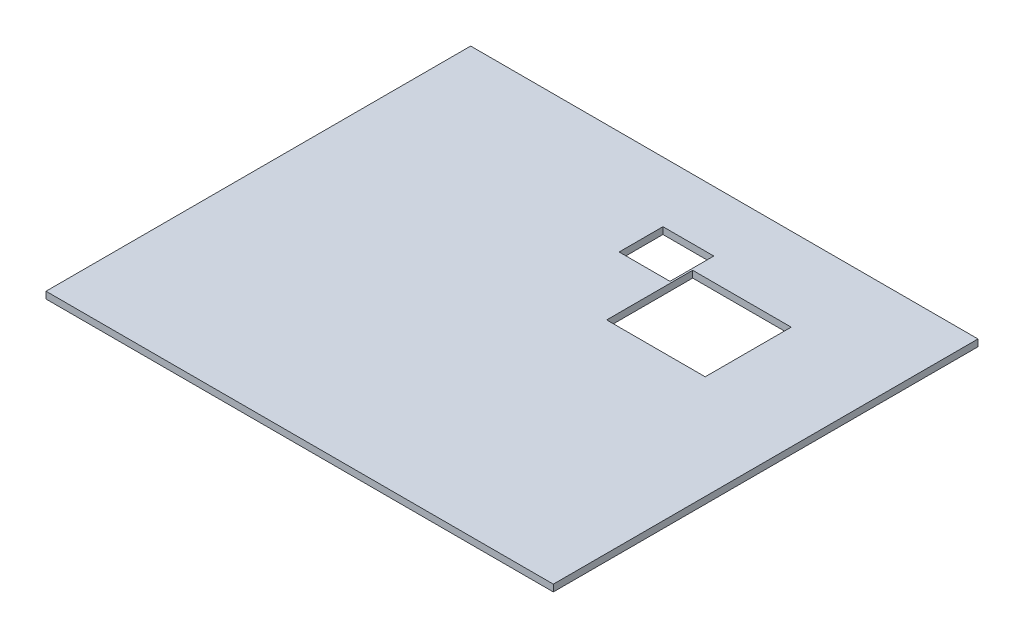
ISO-10303-21;
HEADER;
FILE_DESCRIPTION(('STEP AP214'),'2;1');
FILE_NAME('part.step','',(''),(''),'','','');
FILE_SCHEMA(('AUTOMOTIVE_DESIGN { 1 0 10303 214 1 1 1 1 }'));
ENDSEC;
DATA;
#1=APPLICATION_CONTEXT('core data for automotive mechanical design processes');
#2=APPLICATION_PROTOCOL_DEFINITION('international standard','automotive_design',2000,#1);
#3=PRODUCT_CONTEXT('',#1,'mechanical');
#4=PRODUCT('Part','Part','',(#3));
#5=PRODUCT_RELATED_PRODUCT_CATEGORY('part','',(#4));
#6=PRODUCT_DEFINITION_FORMATION('','',#4);
#7=PRODUCT_DEFINITION_CONTEXT('part definition',#1,'design');
#8=PRODUCT_DEFINITION('design','',#6,#7);
#9=PRODUCT_DEFINITION_SHAPE('','',#8);
#10=(LENGTH_UNIT() NAMED_UNIT(*) SI_UNIT(.MILLI.,.METRE.));
#11=(NAMED_UNIT(*) PLANE_ANGLE_UNIT() SI_UNIT($,.RADIAN.));
#12=(NAMED_UNIT(*) SI_UNIT($,.STERADIAN.) SOLID_ANGLE_UNIT());
#13=UNCERTAINTY_MEASURE_WITH_UNIT(LENGTH_MEASURE(1.E-05),#10,'distance_accuracy_value','');
#14=(GEOMETRIC_REPRESENTATION_CONTEXT(3) GLOBAL_UNCERTAINTY_ASSIGNED_CONTEXT((#13)) GLOBAL_UNIT_ASSIGNED_CONTEXT((#10,
#11,#12)) REPRESENTATION_CONTEXT('',''));
#15=CARTESIAN_POINT('',(0.,0.,0.));
#16=DIRECTION('',(0.,0.,1.));
#17=DIRECTION('',(1.,0.,0.));
#18=AXIS2_PLACEMENT_3D('',#15,#16,#17);
#19=CARTESIAN_POINT('',(0.,1.2,0.));
#20=DIRECTION('',(0.,1.,0.));
#21=DIRECTION('',(0.,0.,1.));
#22=AXIS2_PLACEMENT_3D('',#19,#20,#21);
#23=PLANE('',#22);
#24=DIRECTION('',(0.,0.,1.));
#25=VECTOR('',#24,1.);
#26=CARTESIAN_POINT('',(-44.8,1.2,37.5));
#27=LINE('',#26,#25);
#28=CARTESIAN_POINT('',(-44.8,1.2,-37.5));
#29=VERTEX_POINT('',#28);
#30=CARTESIAN_POINT('',(-44.8,1.2,37.5));
#31=VERTEX_POINT('',#30);
#32=EDGE_CURVE('E189',#29,#31,#27,.T.);
#33=ORIENTED_EDGE('',*,*,#32,.T.);
#34=DIRECTION('',(1.,0.,0.));
#35=VECTOR('',#34,1.);
#36=CARTESIAN_POINT('',(44.8,1.2,37.5));
#37=LINE('',#36,#35);
#38=CARTESIAN_POINT('',(44.8,1.2,37.5));
#39=VERTEX_POINT('',#38);
#40=EDGE_CURVE('E192',#31,#39,#37,.T.);
#41=ORIENTED_EDGE('',*,*,#40,.T.);
#42=DIRECTION('',(0.,0.,-1.));
#43=VECTOR('',#42,1.);
#44=CARTESIAN_POINT('',(44.8,1.2,37.5));
#45=LINE('',#44,#43);
#46=CARTESIAN_POINT('',(44.8,1.2,-37.5));
#47=VERTEX_POINT('',#46);
#48=EDGE_CURVE('E195',#39,#47,#45,.T.);
#49=ORIENTED_EDGE('',*,*,#48,.T.);
#50=DIRECTION('',(-1.,0.,0.));
#51=VECTOR('',#50,1.);
#52=CARTESIAN_POINT('',(44.8,1.2,-37.5));
#53=LINE('',#52,#51);
#54=EDGE_CURVE('E197',#47,#29,#53,.T.);
#55=ORIENTED_EDGE('',*,*,#54,.T.);
#56=EDGE_LOOP('',(#33,#41,#49,#55));
#57=FACE_BOUND('',#56,.T.);
#58=DIRECTION('',(1.,0.,0.));
#59=VECTOR('',#58,1.);
#60=CARTESIAN_POINT('',(9.1,1.2,-7.62));
#61=LINE('',#60,#59);
#62=CARTESIAN_POINT('',(9.1,1.2,-7.62));
#63=VERTEX_POINT('',#62);
#64=CARTESIAN_POINT('',(26.5,1.2,-7.62));
#65=VERTEX_POINT('',#64);
#66=EDGE_CURVE('E160',#63,#65,#61,.T.);
#67=ORIENTED_EDGE('',*,*,#66,.F.);
#68=DIRECTION('',(0.,0.,1.));
#69=VECTOR('',#68,1.);
#70=CARTESIAN_POINT('',(9.1,1.2,-7.62));
#71=LINE('',#70,#69);
#72=CARTESIAN_POINT('',(9.1,1.2,-22.81));
#73=VERTEX_POINT('',#72);
#74=EDGE_CURVE('E158',#73,#63,#71,.T.);
#75=ORIENTED_EDGE('',*,*,#74,.F.);
#76=DIRECTION('',(-1.,0.,0.));
#77=VECTOR('',#76,1.);
#78=CARTESIAN_POINT('',(9.1,1.2,-22.81));
#79=LINE('',#78,#77);
#80=CARTESIAN_POINT('',(26.5,1.2,-22.81));
#81=VERTEX_POINT('',#80);
#82=EDGE_CURVE('E166',#81,#73,#79,.T.);
#83=ORIENTED_EDGE('',*,*,#82,.F.);
#84=DIRECTION('',(0.,0.,-1.));
#85=VECTOR('',#84,1.);
#86=CARTESIAN_POINT('',(26.5,1.2,-7.62));
#87=LINE('',#86,#85);
#88=EDGE_CURVE('E163',#65,#81,#87,.T.);
#89=ORIENTED_EDGE('',*,*,#88,.F.);
#90=EDGE_LOOP('',(#67,#75,#83,#89));
#91=FACE_BOUND('',#90,.T.);
#92=DIRECTION('',(1.,0.,0.));
#93=VECTOR('',#92,1.);
#94=CARTESIAN_POINT('',(-0.189999999999989,1.2,-19.11));
#95=LINE('',#94,#93);
#96=CARTESIAN_POINT('',(-0.189999999999989,1.2,-19.11));
#97=VERTEX_POINT('',#96);
#98=CARTESIAN_POINT('',(8.79000000000001,1.2,-19.11));
#99=VERTEX_POINT('',#98);
#100=EDGE_CURVE('E130',#97,#99,#95,.T.);
#101=ORIENTED_EDGE('',*,*,#100,.F.);
#102=DIRECTION('',(0.,0.,1.));
#103=VECTOR('',#102,1.);
#104=CARTESIAN_POINT('',(-0.189999999999989,1.2,-19.11));
#105=LINE('',#104,#103);
#106=CARTESIAN_POINT('',(-0.189999999999989,1.2,-26.85));
#107=VERTEX_POINT('',#106);
#108=EDGE_CURVE('E122',#107,#97,#105,.T.);
#109=ORIENTED_EDGE('',*,*,#108,.F.);
#110=DIRECTION('',(-1.,0.,0.));
#111=VECTOR('',#110,1.);
#112=CARTESIAN_POINT('',(-0.189999999999989,1.2,-26.85));
#113=LINE('',#112,#111);
#114=CARTESIAN_POINT('',(8.79000000000001,1.2,-26.85));
#115=VERTEX_POINT('',#114);
#116=EDGE_CURVE('E144',#115,#107,#113,.T.);
#117=ORIENTED_EDGE('',*,*,#116,.F.);
#118=DIRECTION('',(0.,0.,-1.));
#119=VECTOR('',#118,1.);
#120=CARTESIAN_POINT('',(8.79000000000001,1.2,-19.11));
#121=LINE('',#120,#119);
#122=EDGE_CURVE('E142',#99,#115,#121,.T.);
#123=ORIENTED_EDGE('',*,*,#122,.F.);
#124=EDGE_LOOP('',(#101,#109,#117,#123));
#125=FACE_BOUND('',#124,.T.);
#126=ADVANCED_FACE('F33',(#57,#91,#125),#23,.T.);
#127=CARTESIAN_POINT('',(0.,0.,0.));
#128=DIRECTION('',(0.,1.,0.));
#129=DIRECTION('',(0.,0.,1.));
#130=AXIS2_PLACEMENT_3D('',#127,#128,#129);
#131=PLANE('',#130);
#132=DIRECTION('',(0.,0.,1.));
#133=VECTOR('',#132,1.);
#134=CARTESIAN_POINT('',(9.1,0.,-7.62));
#135=LINE('',#134,#133);
#136=CARTESIAN_POINT('',(9.1,0.,-22.81));
#137=VERTEX_POINT('',#136);
#138=CARTESIAN_POINT('',(9.1,0.,-7.62));
#139=VERTEX_POINT('',#138);
#140=EDGE_CURVE('E138',#137,#139,#135,.T.);
#141=ORIENTED_EDGE('',*,*,#140,.T.);
#142=DIRECTION('',(1.,0.,0.));
#143=VECTOR('',#142,1.);
#144=CARTESIAN_POINT('',(9.1,0.,-7.62));
#145=LINE('',#144,#143);
#146=CARTESIAN_POINT('',(26.5,0.,-7.62));
#147=VERTEX_POINT('',#146);
#148=EDGE_CURVE('E171',#139,#147,#145,.T.);
#149=ORIENTED_EDGE('',*,*,#148,.T.);
#150=DIRECTION('',(0.,0.,-1.));
#151=VECTOR('',#150,1.);
#152=CARTESIAN_POINT('',(26.5,0.,-7.62));
#153=LINE('',#152,#151);
#154=CARTESIAN_POINT('',(26.5,0.,-22.81));
#155=VERTEX_POINT('',#154);
#156=EDGE_CURVE('E174',#147,#155,#153,.T.);
#157=ORIENTED_EDGE('',*,*,#156,.T.);
#158=DIRECTION('',(-1.,0.,0.));
#159=VECTOR('',#158,1.);
#160=CARTESIAN_POINT('',(9.1,0.,-22.81));
#161=LINE('',#160,#159);
#162=EDGE_CURVE('E161',#155,#137,#161,.T.);
#163=ORIENTED_EDGE('',*,*,#162,.T.);
#164=EDGE_LOOP('',(#141,#149,#157,#163));
#165=FACE_BOUND('',#164,.T.);
#166=DIRECTION('',(0.,0.,1.));
#167=VECTOR('',#166,1.);
#168=CARTESIAN_POINT('',(-44.8,0.,37.5));
#169=LINE('',#168,#167);
#170=CARTESIAN_POINT('',(-44.8,0.,-37.5));
#171=VERTEX_POINT('',#170);
#172=CARTESIAN_POINT('',(-44.8,0.,37.5));
#173=VERTEX_POINT('',#172);
#174=EDGE_CURVE('E188',#171,#173,#169,.T.);
#175=ORIENTED_EDGE('',*,*,#174,.F.);
#176=DIRECTION('',(-1.,0.,0.));
#177=VECTOR('',#176,1.);
#178=CARTESIAN_POINT('',(44.8,0.,-37.5));
#179=LINE('',#178,#177);
#180=CARTESIAN_POINT('',(44.8,0.,-37.5));
#181=VERTEX_POINT('',#180);
#182=EDGE_CURVE('E193',#181,#171,#179,.T.);
#183=ORIENTED_EDGE('',*,*,#182,.F.);
#184=DIRECTION('',(0.,0.,-1.));
#185=VECTOR('',#184,1.);
#186=CARTESIAN_POINT('',(44.8,0.,37.5));
#187=LINE('',#186,#185);
#188=CARTESIAN_POINT('',(44.8,0.,37.5));
#189=VERTEX_POINT('',#188);
#190=EDGE_CURVE('E204',#189,#181,#187,.T.);
#191=ORIENTED_EDGE('',*,*,#190,.F.);
#192=DIRECTION('',(1.,0.,0.));
#193=VECTOR('',#192,1.);
#194=CARTESIAN_POINT('',(44.8,0.,37.5));
#195=LINE('',#194,#193);
#196=EDGE_CURVE('E202',#173,#189,#195,.T.);
#197=ORIENTED_EDGE('',*,*,#196,.F.);
#198=EDGE_LOOP('',(#175,#183,#191,#197));
#199=FACE_BOUND('',#198,.T.);
#200=DIRECTION('',(0.,0.,1.));
#201=VECTOR('',#200,1.);
#202=CARTESIAN_POINT('',(-0.189999999999989,0.,-19.11));
#203=LINE('',#202,#201);
#204=CARTESIAN_POINT('',(-0.189999999999989,0.,-26.85));
#205=VERTEX_POINT('',#204);
#206=CARTESIAN_POINT('',(-0.189999999999989,0.,-19.11));
#207=VERTEX_POINT('',#206);
#208=EDGE_CURVE('E56',#205,#207,#203,.T.);
#209=ORIENTED_EDGE('',*,*,#208,.T.);
#210=DIRECTION('',(1.,0.,0.));
#211=VECTOR('',#210,1.);
#212=CARTESIAN_POINT('',(-0.189999999999989,0.,-19.11));
#213=LINE('',#212,#211);
#214=CARTESIAN_POINT('',(8.79000000000001,0.,-19.11));
#215=VERTEX_POINT('',#214);
#216=EDGE_CURVE('E137',#207,#215,#213,.T.);
#217=ORIENTED_EDGE('',*,*,#216,.T.);
#218=DIRECTION('',(0.,0.,-1.));
#219=VECTOR('',#218,1.);
#220=CARTESIAN_POINT('',(8.79000000000001,0.,-19.11));
#221=LINE('',#220,#219);
#222=CARTESIAN_POINT('',(8.79000000000001,0.,-26.85));
#223=VERTEX_POINT('',#222);
#224=EDGE_CURVE('E150',#215,#223,#221,.T.);
#225=ORIENTED_EDGE('',*,*,#224,.T.);
#226=DIRECTION('',(-1.,0.,0.));
#227=VECTOR('',#226,1.);
#228=CARTESIAN_POINT('',(-0.189999999999989,0.,-26.85));
#229=LINE('',#228,#227);
#230=EDGE_CURVE('E131',#223,#205,#229,.T.);
#231=ORIENTED_EDGE('',*,*,#230,.T.);
#232=EDGE_LOOP('',(#209,#217,#225,#231));
#233=FACE_BOUND('',#232,.T.);
#234=ADVANCED_FACE('F222',(#165,#199,#233),#131,.F.);
#235=CARTESIAN_POINT('',(-44.8,1.2,37.5));
#236=DIRECTION('',(1.,0.,0.));
#237=DIRECTION('',(0.,0.,-1.));
#238=AXIS2_PLACEMENT_3D('',#235,#236,#237);
#239=PLANE('',#238);
#240=ORIENTED_EDGE('',*,*,#174,.T.);
#241=DIRECTION('',(0.,-1.,0.));
#242=VECTOR('',#241,1.);
#243=CARTESIAN_POINT('',(-44.8,1.2,37.5));
#244=LINE('',#243,#242);
#245=EDGE_CURVE('E11',#31,#173,#244,.T.);
#246=ORIENTED_EDGE('',*,*,#245,.F.);
#247=ORIENTED_EDGE('',*,*,#32,.F.);
#248=DIRECTION('',(0.,-1.,0.));
#249=VECTOR('',#248,1.);
#250=CARTESIAN_POINT('',(-44.8,1.2,-37.5));
#251=LINE('',#250,#249);
#252=EDGE_CURVE('E199',#29,#171,#251,.T.);
#253=ORIENTED_EDGE('',*,*,#252,.T.);
#254=EDGE_LOOP('',(#240,#246,#247,#253));
#255=FACE_BOUND('',#254,.T.);
#256=ADVANCED_FACE('F35',(#255),#239,.F.);
#257=CARTESIAN_POINT('',(44.8,1.2,37.5));
#258=DIRECTION('',(0.,0.,-1.));
#259=DIRECTION('',(-1.,0.,0.));
#260=AXIS2_PLACEMENT_3D('',#257,#258,#259);
#261=PLANE('',#260);
#262=ORIENTED_EDGE('',*,*,#196,.T.);
#263=DIRECTION('',(0.,-1.,0.));
#264=VECTOR('',#263,1.);
#265=CARTESIAN_POINT('',(44.8,1.2,37.5));
#266=LINE('',#265,#264);
#267=EDGE_CURVE('E41',#39,#189,#266,.T.);
#268=ORIENTED_EDGE('',*,*,#267,.F.);
#269=ORIENTED_EDGE('',*,*,#40,.F.);
#270=ORIENTED_EDGE('',*,*,#245,.T.);
#271=EDGE_LOOP('',(#262,#268,#269,#270));
#272=FACE_BOUND('',#271,.T.);
#273=ADVANCED_FACE('F233',(#272),#261,.F.);
#274=CARTESIAN_POINT('',(44.8,1.2,37.5));
#275=DIRECTION('',(-1.,0.,0.));
#276=DIRECTION('',(0.,0.,1.));
#277=AXIS2_PLACEMENT_3D('',#274,#275,#276);
#278=PLANE('',#277);
#279=ORIENTED_EDGE('',*,*,#190,.T.);
#280=DIRECTION('',(0.,-1.,0.));
#281=VECTOR('',#280,1.);
#282=CARTESIAN_POINT('',(44.8,1.2,-37.5));
#283=LINE('',#282,#281);
#284=EDGE_CURVE('E209',#47,#181,#283,.T.);
#285=ORIENTED_EDGE('',*,*,#284,.F.);
#286=ORIENTED_EDGE('',*,*,#48,.F.);
#287=ORIENTED_EDGE('',*,*,#267,.T.);
#288=EDGE_LOOP('',(#279,#285,#286,#287));
#289=FACE_BOUND('',#288,.T.);
#290=ADVANCED_FACE('F216',(#289),#278,.F.);
#291=CARTESIAN_POINT('',(44.8,1.2,-37.5));
#292=DIRECTION('',(0.,0.,1.));
#293=DIRECTION('',(1.,0.,0.));
#294=AXIS2_PLACEMENT_3D('',#291,#292,#293);
#295=PLANE('',#294);
#296=ORIENTED_EDGE('',*,*,#182,.T.);
#297=ORIENTED_EDGE('',*,*,#252,.F.);
#298=ORIENTED_EDGE('',*,*,#54,.F.);
#299=ORIENTED_EDGE('',*,*,#284,.T.);
#300=EDGE_LOOP('',(#296,#297,#298,#299));
#301=FACE_BOUND('',#300,.T.);
#302=ADVANCED_FACE('F226',(#301),#295,.F.);
#303=CARTESIAN_POINT('',(9.1,1.2,-7.62));
#304=DIRECTION('',(1.,0.,0.));
#305=DIRECTION('',(0.,0.,-1.));
#306=AXIS2_PLACEMENT_3D('',#303,#304,#305);
#307=PLANE('',#306);
#308=ORIENTED_EDGE('',*,*,#140,.F.);
#309=DIRECTION('',(0.,-1.,0.));
#310=VECTOR('',#309,1.);
#311=CARTESIAN_POINT('',(9.1,1.2,-22.81));
#312=LINE('',#311,#310);
#313=EDGE_CURVE('E168',#73,#137,#312,.T.);
#314=ORIENTED_EDGE('',*,*,#313,.F.);
#315=ORIENTED_EDGE('',*,*,#74,.T.);
#316=DIRECTION('',(0.,-1.,0.));
#317=VECTOR('',#316,1.);
#318=CARTESIAN_POINT('',(9.1,1.2,-7.62));
#319=LINE('',#318,#317);
#320=EDGE_CURVE('E185',#63,#139,#319,.T.);
#321=ORIENTED_EDGE('',*,*,#320,.T.);
#322=EDGE_LOOP('',(#308,#314,#315,#321));
#323=FACE_BOUND('',#322,.T.);
#324=ADVANCED_FACE('F248',(#323),#307,.T.);
#325=CARTESIAN_POINT('',(9.1,1.2,-7.62));
#326=DIRECTION('',(0.,0.,-1.));
#327=DIRECTION('',(-1.,0.,0.));
#328=AXIS2_PLACEMENT_3D('',#325,#326,#327);
#329=PLANE('',#328);
#330=ORIENTED_EDGE('',*,*,#148,.F.);
#331=ORIENTED_EDGE('',*,*,#320,.F.);
#332=ORIENTED_EDGE('',*,*,#66,.T.);
#333=DIRECTION('',(0.,-1.,0.));
#334=VECTOR('',#333,1.);
#335=CARTESIAN_POINT('',(26.5,1.2,-7.62));
#336=LINE('',#335,#334);
#337=EDGE_CURVE('E183',#65,#147,#336,.T.);
#338=ORIENTED_EDGE('',*,*,#337,.T.);
#339=EDGE_LOOP('',(#330,#331,#332,#338));
#340=FACE_BOUND('',#339,.T.);
#341=ADVANCED_FACE('F255',(#340),#329,.T.);
#342=CARTESIAN_POINT('',(26.5,1.2,-7.62));
#343=DIRECTION('',(-1.,0.,0.));
#344=DIRECTION('',(0.,0.,1.));
#345=AXIS2_PLACEMENT_3D('',#342,#343,#344);
#346=PLANE('',#345);
#347=ORIENTED_EDGE('',*,*,#156,.F.);
#348=ORIENTED_EDGE('',*,*,#337,.F.);
#349=ORIENTED_EDGE('',*,*,#88,.T.);
#350=DIRECTION('',(0.,-1.,0.));
#351=VECTOR('',#350,1.);
#352=CARTESIAN_POINT('',(26.5,1.2,-22.81));
#353=LINE('',#352,#351);
#354=EDGE_CURVE('E181',#81,#155,#353,.T.);
#355=ORIENTED_EDGE('',*,*,#354,.T.);
#356=EDGE_LOOP('',(#347,#348,#349,#355));
#357=FACE_BOUND('',#356,.T.);
#358=ADVANCED_FACE('F260',(#357),#346,.T.);
#359=CARTESIAN_POINT('',(9.1,1.2,-22.81));
#360=DIRECTION('',(0.,0.,1.));
#361=DIRECTION('',(1.,0.,0.));
#362=AXIS2_PLACEMENT_3D('',#359,#360,#361);
#363=PLANE('',#362);
#364=ORIENTED_EDGE('',*,*,#162,.F.);
#365=ORIENTED_EDGE('',*,*,#354,.F.);
#366=ORIENTED_EDGE('',*,*,#82,.T.);
#367=ORIENTED_EDGE('',*,*,#313,.T.);
#368=EDGE_LOOP('',(#364,#365,#366,#367));
#369=FACE_BOUND('',#368,.T.);
#370=ADVANCED_FACE('F267',(#369),#363,.T.);
#371=CARTESIAN_POINT('',(-0.189999999999989,1.2,-19.11));
#372=DIRECTION('',(1.,0.,0.));
#373=DIRECTION('',(0.,0.,-1.));
#374=AXIS2_PLACEMENT_3D('',#371,#372,#373);
#375=PLANE('',#374);
#376=ORIENTED_EDGE('',*,*,#208,.F.);
#377=DIRECTION('',(0.,-1.,0.));
#378=VECTOR('',#377,1.);
#379=CARTESIAN_POINT('',(-0.189999999999989,1.2,-26.85));
#380=LINE('',#379,#378);
#381=EDGE_CURVE('E126',#107,#205,#380,.T.);
#382=ORIENTED_EDGE('',*,*,#381,.F.);
#383=ORIENTED_EDGE('',*,*,#108,.T.);
#384=DIRECTION('',(0.,-1.,0.));
#385=VECTOR('',#384,1.);
#386=CARTESIAN_POINT('',(-0.189999999999989,1.2,-19.11));
#387=LINE('',#386,#385);
#388=EDGE_CURVE('E125',#97,#207,#387,.T.);
#389=ORIENTED_EDGE('',*,*,#388,.T.);
#390=EDGE_LOOP('',(#376,#382,#383,#389));
#391=FACE_BOUND('',#390,.T.);
#392=ADVANCED_FACE('F124',(#391),#375,.T.);
#393=CARTESIAN_POINT('',(-0.189999999999989,1.2,-19.11));
#394=DIRECTION('',(0.,0.,-1.));
#395=DIRECTION('',(-1.,0.,0.));
#396=AXIS2_PLACEMENT_3D('',#393,#394,#395);
#397=PLANE('',#396);
#398=ORIENTED_EDGE('',*,*,#216,.F.);
#399=ORIENTED_EDGE('',*,*,#388,.F.);
#400=ORIENTED_EDGE('',*,*,#100,.T.);
#401=DIRECTION('',(0.,-1.,0.));
#402=VECTOR('',#401,1.);
#403=CARTESIAN_POINT('',(8.79000000000001,1.2,-19.11));
#404=LINE('',#403,#402);
#405=EDGE_CURVE('E139',#99,#215,#404,.T.);
#406=ORIENTED_EDGE('',*,*,#405,.T.);
#407=EDGE_LOOP('',(#398,#399,#400,#406));
#408=FACE_BOUND('',#407,.T.);
#409=ADVANCED_FACE('F134',(#408),#397,.T.);
#410=CARTESIAN_POINT('',(8.79000000000001,1.2,-19.11));
#411=DIRECTION('',(-1.,0.,0.));
#412=DIRECTION('',(0.,0.,1.));
#413=AXIS2_PLACEMENT_3D('',#410,#411,#412);
#414=PLANE('',#413);
#415=ORIENTED_EDGE('',*,*,#224,.F.);
#416=ORIENTED_EDGE('',*,*,#405,.F.);
#417=ORIENTED_EDGE('',*,*,#122,.T.);
#418=DIRECTION('',(0.,-1.,0.));
#419=VECTOR('',#418,1.);
#420=CARTESIAN_POINT('',(8.79000000000001,1.2,-26.85));
#421=LINE('',#420,#419);
#422=EDGE_CURVE('E48',#115,#223,#421,.T.);
#423=ORIENTED_EDGE('',*,*,#422,.T.);
#424=EDGE_LOOP('',(#415,#416,#417,#423));
#425=FACE_BOUND('',#424,.T.);
#426=ADVANCED_FACE('F285',(#425),#414,.T.);
#427=CARTESIAN_POINT('',(-0.189999999999989,1.2,-26.85));
#428=DIRECTION('',(0.,0.,1.));
#429=DIRECTION('',(1.,0.,0.));
#430=AXIS2_PLACEMENT_3D('',#427,#428,#429);
#431=PLANE('',#430);
#432=ORIENTED_EDGE('',*,*,#230,.F.);
#433=ORIENTED_EDGE('',*,*,#422,.F.);
#434=ORIENTED_EDGE('',*,*,#116,.T.);
#435=ORIENTED_EDGE('',*,*,#381,.T.);
#436=EDGE_LOOP('',(#432,#433,#434,#435));
#437=FACE_BOUND('',#436,.T.);
#438=ADVANCED_FACE('F288',(#437),#431,.T.);
#439=CLOSED_SHELL('',(#126,#234,#256,#273,#290,#302,#324,#341,#358,#370,#392,#409,#426,#438));
#440=MANIFOLD_SOLID_BREP('B2',#439);
#441=ADVANCED_BREP_SHAPE_REPRESENTATION('',(#18,#440),#14);
#442=SHAPE_DEFINITION_REPRESENTATION(#9,#441);
ENDSEC;
END-ISO-10303-21;
